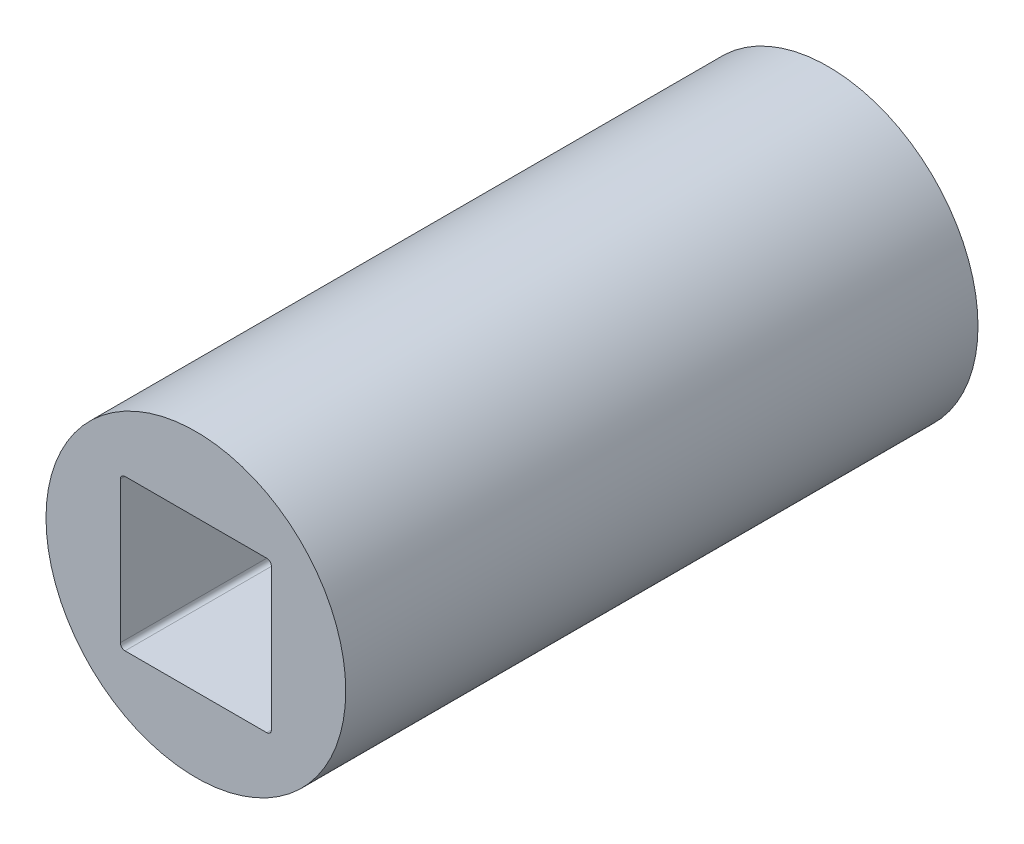
ISO-10303-21;
HEADER;
FILE_DESCRIPTION(('STEP AP214'),'2;1');
FILE_NAME('part.step','',(''),(''),'','','');
FILE_SCHEMA(('AUTOMOTIVE_DESIGN { 1 0 10303 214 1 1 1 1 }'));
ENDSEC;
DATA;
#1=APPLICATION_CONTEXT('core data for automotive mechanical design processes');
#2=APPLICATION_PROTOCOL_DEFINITION('international standard','automotive_design',2000,#1);
#3=PRODUCT_CONTEXT('',#1,'mechanical');
#4=PRODUCT('Part','Part','',(#3));
#5=PRODUCT_RELATED_PRODUCT_CATEGORY('part','',(#4));
#6=PRODUCT_DEFINITION_FORMATION('','',#4);
#7=PRODUCT_DEFINITION_CONTEXT('part definition',#1,'design');
#8=PRODUCT_DEFINITION('design','',#6,#7);
#9=PRODUCT_DEFINITION_SHAPE('','',#8);
#10=(LENGTH_UNIT() NAMED_UNIT(*) SI_UNIT(.MILLI.,.METRE.));
#11=(NAMED_UNIT(*) PLANE_ANGLE_UNIT() SI_UNIT($,.RADIAN.));
#12=(NAMED_UNIT(*) SI_UNIT($,.STERADIAN.) SOLID_ANGLE_UNIT());
#13=UNCERTAINTY_MEASURE_WITH_UNIT(LENGTH_MEASURE(1.E-05),#10,'distance_accuracy_value','');
#14=(GEOMETRIC_REPRESENTATION_CONTEXT(3) GLOBAL_UNCERTAINTY_ASSIGNED_CONTEXT((#13)) GLOBAL_UNIT_ASSIGNED_CONTEXT((#10,
#11,#12)) REPRESENTATION_CONTEXT('',''));
#15=CARTESIAN_POINT('',(0.,0.,0.));
#16=DIRECTION('',(0.,0.,1.));
#17=DIRECTION('',(1.,0.,0.));
#18=AXIS2_PLACEMENT_3D('',#15,#16,#17);
#19=CARTESIAN_POINT('',(0.,0.,6.75));
#20=DIRECTION('',(0.,0.,-1.));
#21=DIRECTION('',(-1.,0.,0.));
#22=AXIS2_PLACEMENT_3D('',#19,#20,#21);
#23=CYLINDRICAL_SURFACE('',#22,1.5875);
#24=CARTESIAN_POINT('',(0.,0.,-1.));
#25=DIRECTION('',(0.,0.,-1.));
#26=DIRECTION('',(-1.,0.,0.));
#27=AXIS2_PLACEMENT_3D('',#24,#25,#26);
#28=CIRCLE('',#27,1.5875);
#29=CARTESIAN_POINT('',(-1.5875,0.,-1.));
#30=VERTEX_POINT('',#29);
#31=EDGE_CURVE('E163',#30,#30,#28,.F.);
#32=ORIENTED_EDGE('',*,*,#31,.F.);
#33=EDGE_LOOP('',(#32));
#34=FACE_BOUND('',#33,.T.);
#35=CARTESIAN_POINT('',(0.,0.,1.));
#36=DIRECTION('',(0.,0.,-1.));
#37=DIRECTION('',(-1.,0.,0.));
#38=AXIS2_PLACEMENT_3D('',#35,#36,#37);
#39=CIRCLE('',#38,1.5875);
#40=CARTESIAN_POINT('',(-1.5875,0.,1.));
#41=VERTEX_POINT('',#40);
#42=EDGE_CURVE('E42',#41,#41,#39,.T.);
#43=ORIENTED_EDGE('',*,*,#42,.F.);
#44=EDGE_LOOP('',(#43));
#45=FACE_BOUND('',#44,.T.);
#46=ADVANCED_FACE('F39',(#34,#45),#23,.F.);
#47=CARTESIAN_POINT('',(0.,0.,1.));
#48=DIRECTION('',(0.,0.,1.));
#49=DIRECTION('',(1.,0.,0.));
#50=AXIS2_PLACEMENT_3D('',#47,#48,#49);
#51=PLANE('',#50);
#52=DIRECTION('',(1.,0.,0.));
#53=VECTOR('',#52,1.);
#54=CARTESIAN_POINT('',(-1.6129,-1.6129,1.));
#55=LINE('',#54,#53);
#56=CARTESIAN_POINT('',(-1.5129,-1.6129,1.));
#57=VERTEX_POINT('',#56);
#58=CARTESIAN_POINT('',(1.5129,-1.6129,1.));
#59=VERTEX_POINT('',#58);
#60=EDGE_CURVE('E149',#57,#59,#55,.T.);
#61=ORIENTED_EDGE('',*,*,#60,.T.);
#62=CARTESIAN_POINT('',(1.5129,-1.5129,1.));
#63=DIRECTION('',(0.,0.,-1.));
#64=DIRECTION('',(-1.,0.,0.));
#65=AXIS2_PLACEMENT_3D('',#62,#63,#64);
#66=CIRCLE('',#65,0.1);
#67=CARTESIAN_POINT('',(1.6129,-1.5129,1.));
#68=VERTEX_POINT('',#67);
#69=EDGE_CURVE('E165',#59,#68,#66,.F.);
#70=ORIENTED_EDGE('',*,*,#69,.T.);
#71=DIRECTION('',(0.,1.,0.));
#72=VECTOR('',#71,1.);
#73=CARTESIAN_POINT('',(1.6129,1.6129,1.));
#74=LINE('',#73,#72);
#75=CARTESIAN_POINT('',(1.6129,1.5129,1.));
#76=VERTEX_POINT('',#75);
#77=EDGE_CURVE('E154',#68,#76,#74,.T.);
#78=ORIENTED_EDGE('',*,*,#77,.T.);
#79=CARTESIAN_POINT('',(1.5129,1.5129,1.));
#80=DIRECTION('',(0.,0.,-1.));
#81=DIRECTION('',(-1.,0.,0.));
#82=AXIS2_PLACEMENT_3D('',#79,#80,#81);
#83=CIRCLE('',#82,0.1);
#84=CARTESIAN_POINT('',(1.5129,1.6129,1.));
#85=VERTEX_POINT('',#84);
#86=EDGE_CURVE('E238',#76,#85,#83,.F.);
#87=ORIENTED_EDGE('',*,*,#86,.T.);
#88=DIRECTION('',(1.,0.,0.));
#89=VECTOR('',#88,1.);
#90=CARTESIAN_POINT('',(-1.6129,1.6129,1.));
#91=LINE('',#90,#89);
#92=CARTESIAN_POINT('',(-1.5129,1.6129,1.));
#93=VERTEX_POINT('',#92);
#94=EDGE_CURVE('E196',#85,#93,#91,.F.);
#95=ORIENTED_EDGE('',*,*,#94,.T.);
#96=CARTESIAN_POINT('',(-1.5129,1.5129,1.));
#97=DIRECTION('',(0.,0.,-1.));
#98=DIRECTION('',(-1.,0.,0.));
#99=AXIS2_PLACEMENT_3D('',#96,#97,#98);
#100=CIRCLE('',#99,0.1);
#101=CARTESIAN_POINT('',(-1.6129,1.5129,1.));
#102=VERTEX_POINT('',#101);
#103=EDGE_CURVE('E240',#93,#102,#100,.F.);
#104=ORIENTED_EDGE('',*,*,#103,.T.);
#105=DIRECTION('',(0.,-1.,0.));
#106=VECTOR('',#105,1.);
#107=CARTESIAN_POINT('',(-1.6129,1.6129,1.));
#108=LINE('',#107,#106);
#109=CARTESIAN_POINT('',(-1.6129,-1.5129,1.));
#110=VERTEX_POINT('',#109);
#111=EDGE_CURVE('E201',#102,#110,#108,.T.);
#112=ORIENTED_EDGE('',*,*,#111,.T.);
#113=CARTESIAN_POINT('',(-1.5129,-1.5129,1.));
#114=DIRECTION('',(0.,0.,-1.));
#115=DIRECTION('',(-1.,0.,0.));
#116=AXIS2_PLACEMENT_3D('',#113,#114,#115);
#117=CIRCLE('',#116,0.1);
#118=EDGE_CURVE('E204',#110,#57,#117,.F.);
#119=ORIENTED_EDGE('',*,*,#118,.T.);
#120=EDGE_LOOP('',(#61,#70,#78,#87,#95,#104,#112,#119));
#121=FACE_BOUND('',#120,.T.);
#122=ORIENTED_EDGE('',*,*,#42,.T.);
#123=EDGE_LOOP('',(#122));
#124=FACE_BOUND('',#123,.T.);
#125=ADVANCED_FACE('F166',(#121,#124),#51,.T.);
#126=CARTESIAN_POINT('',(0.,0.,-1.));
#127=DIRECTION('',(0.,0.,-1.));
#128=DIRECTION('',(-1.,0.,0.));
#129=AXIS2_PLACEMENT_3D('',#126,#127,#128);
#130=PLANE('',#129);
#131=DIRECTION('',(0.,-1.,0.));
#132=VECTOR('',#131,1.);
#133=CARTESIAN_POINT('',(-1.6129,1.6129,-1.));
#134=LINE('',#133,#132);
#135=CARTESIAN_POINT('',(-1.6129,-1.5129,-1.));
#136=VERTEX_POINT('',#135);
#137=CARTESIAN_POINT('',(-1.6129,1.5129,-1.));
#138=VERTEX_POINT('',#137);
#139=EDGE_CURVE('E180',#136,#138,#134,.F.);
#140=ORIENTED_EDGE('',*,*,#139,.T.);
#141=CARTESIAN_POINT('',(-1.5129,1.5129,-1.));
#142=DIRECTION('',(0.,0.,1.));
#143=DIRECTION('',(1.,0.,0.));
#144=AXIS2_PLACEMENT_3D('',#141,#142,#143);
#145=CIRCLE('',#144,0.1);
#146=CARTESIAN_POINT('',(-1.5129,1.6129,-1.));
#147=VERTEX_POINT('',#146);
#148=EDGE_CURVE('E236',#138,#147,#145,.F.);
#149=ORIENTED_EDGE('',*,*,#148,.T.);
#150=DIRECTION('',(1.,0.,0.));
#151=VECTOR('',#150,1.);
#152=CARTESIAN_POINT('',(-1.6129,1.6129,-1.));
#153=LINE('',#152,#151);
#154=CARTESIAN_POINT('',(1.5129,1.6129,-1.));
#155=VERTEX_POINT('',#154);
#156=EDGE_CURVE('E192',#147,#155,#153,.T.);
#157=ORIENTED_EDGE('',*,*,#156,.T.);
#158=CARTESIAN_POINT('',(1.5129,1.5129,-1.));
#159=DIRECTION('',(0.,0.,1.));
#160=DIRECTION('',(1.,0.,0.));
#161=AXIS2_PLACEMENT_3D('',#158,#159,#160);
#162=CIRCLE('',#161,0.1);
#163=CARTESIAN_POINT('',(1.6129,1.5129,-1.));
#164=VERTEX_POINT('',#163);
#165=EDGE_CURVE('E234',#155,#164,#162,.F.);
#166=ORIENTED_EDGE('',*,*,#165,.T.);
#167=DIRECTION('',(0.,1.,0.));
#168=VECTOR('',#167,1.);
#169=CARTESIAN_POINT('',(1.6129,1.6129,-1.));
#170=LINE('',#169,#168);
#171=CARTESIAN_POINT('',(1.6129,-1.5129,-1.));
#172=VERTEX_POINT('',#171);
#173=EDGE_CURVE('E188',#164,#172,#170,.F.);
#174=ORIENTED_EDGE('',*,*,#173,.T.);
#175=CARTESIAN_POINT('',(1.5129,-1.5129,-1.));
#176=DIRECTION('',(0.,0.,1.));
#177=DIRECTION('',(1.,0.,0.));
#178=AXIS2_PLACEMENT_3D('',#175,#176,#177);
#179=CIRCLE('',#178,0.1);
#180=CARTESIAN_POINT('',(1.5129,-1.6129,-1.));
#181=VERTEX_POINT('',#180);
#182=EDGE_CURVE('E232',#172,#181,#179,.F.);
#183=ORIENTED_EDGE('',*,*,#182,.T.);
#184=DIRECTION('',(1.,0.,0.));
#185=VECTOR('',#184,1.);
#186=CARTESIAN_POINT('',(-1.6129,-1.6129,-1.));
#187=LINE('',#186,#185);
#188=CARTESIAN_POINT('',(-1.5129,-1.6129,-1.));
#189=VERTEX_POINT('',#188);
#190=EDGE_CURVE('E184',#181,#189,#187,.F.);
#191=ORIENTED_EDGE('',*,*,#190,.T.);
#192=CARTESIAN_POINT('',(-1.5129,-1.5129,-1.));
#193=DIRECTION('',(0.,0.,1.));
#194=DIRECTION('',(1.,0.,0.));
#195=AXIS2_PLACEMENT_3D('',#192,#193,#194);
#196=CIRCLE('',#195,0.1);
#197=EDGE_CURVE('E230',#189,#136,#196,.F.);
#198=ORIENTED_EDGE('',*,*,#197,.T.);
#199=EDGE_LOOP('',(#140,#149,#157,#166,#174,#183,#191,#198));
#200=FACE_BOUND('',#199,.T.);
#201=ORIENTED_EDGE('',*,*,#31,.T.);
#202=EDGE_LOOP('',(#201));
#203=FACE_BOUND('',#202,.T.);
#204=ADVANCED_FACE('F438',(#200,#203),#130,.T.);
#205=CARTESIAN_POINT('',(1.6129,1.6129,-4.56197010950313));
#206=DIRECTION('',(1.,0.,0.));
#207=DIRECTION('',(0.,1.,0.));
#208=AXIS2_PLACEMENT_3D('',#205,#206,#207);
#209=PLANE('',#208);
#210=DIRECTION('',(0.,0.,-1.));
#211=VECTOR('',#210,1.);
#212=CARTESIAN_POINT('',(1.6129,1.5129,-4.56197010950313));
#213=LINE('',#212,#211);
#214=CARTESIAN_POINT('',(1.6129,1.5129,6.75));
#215=VERTEX_POINT('',#214);
#216=EDGE_CURVE('E160',#215,#76,#213,.T.);
#217=ORIENTED_EDGE('',*,*,#216,.T.);
#218=ORIENTED_EDGE('',*,*,#77,.F.);
#219=DIRECTION('',(0.,0.,-1.));
#220=VECTOR('',#219,1.);
#221=CARTESIAN_POINT('',(1.6129,-1.5129,-4.56197010950313));
#222=LINE('',#221,#220);
#223=CARTESIAN_POINT('',(1.6129,-1.5129,6.75));
#224=VERTEX_POINT('',#223);
#225=EDGE_CURVE('E157',#68,#224,#222,.F.);
#226=ORIENTED_EDGE('',*,*,#225,.T.);
#227=DIRECTION('',(0.,1.,0.));
#228=VECTOR('',#227,1.);
#229=CARTESIAN_POINT('',(1.6129,0.,6.75));
#230=LINE('',#229,#228);
#231=EDGE_CURVE('E229',#215,#224,#230,.F.);
#232=ORIENTED_EDGE('',*,*,#231,.F.);
#233=EDGE_LOOP('',(#217,#218,#226,#232));
#234=FACE_BOUND('',#233,.T.);
#235=ADVANCED_FACE('F155',(#234),#209,.F.);
#236=CARTESIAN_POINT('',(1.5129,-1.5129,-4.56197010950313));
#237=DIRECTION('',(0.,0.,-1.));
#238=DIRECTION('',(-1.,0.,0.));
#239=AXIS2_PLACEMENT_3D('',#236,#237,#238);
#240=CYLINDRICAL_SURFACE('',#239,0.1);
#241=DIRECTION('',(0.,0.,-1.));
#242=VECTOR('',#241,1.);
#243=CARTESIAN_POINT('',(1.5129,-1.6129,-4.56197010950313));
#244=LINE('',#243,#242);
#245=CARTESIAN_POINT('',(1.5129,-1.6129,6.75));
#246=VERTEX_POINT('',#245);
#247=EDGE_CURVE('E178',#59,#246,#244,.F.);
#248=ORIENTED_EDGE('',*,*,#247,.T.);
#249=CARTESIAN_POINT('',(1.5129,-1.5129,6.75));
#250=DIRECTION('',(0.,0.,-1.));
#251=DIRECTION('',(-1.,0.,0.));
#252=AXIS2_PLACEMENT_3D('',#249,#250,#251);
#253=CIRCLE('',#252,0.1);
#254=EDGE_CURVE('E173',#224,#246,#253,.T.);
#255=ORIENTED_EDGE('',*,*,#254,.F.);
#256=ORIENTED_EDGE('',*,*,#225,.F.);
#257=ORIENTED_EDGE('',*,*,#69,.F.);
#258=EDGE_LOOP('',(#248,#255,#256,#257));
#259=FACE_BOUND('',#258,.T.);
#260=ADVANCED_FACE('F171',(#259),#240,.F.);
#261=CARTESIAN_POINT('',(-1.6129,-1.6129,-4.56197010950313));
#262=DIRECTION('',(0.,-1.,0.));
#263=DIRECTION('',(0.,0.,-1.));
#264=AXIS2_PLACEMENT_3D('',#261,#262,#263);
#265=PLANE('',#264);
#266=ORIENTED_EDGE('',*,*,#247,.F.);
#267=ORIENTED_EDGE('',*,*,#60,.F.);
#268=DIRECTION('',(0.,0.,-1.));
#269=VECTOR('',#268,1.);
#270=CARTESIAN_POINT('',(-1.5129,-1.6129,-4.56197010950313));
#271=LINE('',#270,#269);
#272=CARTESIAN_POINT('',(-1.5129,-1.6129,6.75));
#273=VERTEX_POINT('',#272);
#274=EDGE_CURVE('E244',#57,#273,#271,.F.);
#275=ORIENTED_EDGE('',*,*,#274,.T.);
#276=DIRECTION('',(1.,0.,0.));
#277=VECTOR('',#276,1.);
#278=CARTESIAN_POINT('',(0.,-1.6129,6.75));
#279=LINE('',#278,#277);
#280=EDGE_CURVE('E227',#246,#273,#279,.F.);
#281=ORIENTED_EDGE('',*,*,#280,.F.);
#282=EDGE_LOOP('',(#266,#267,#275,#281));
#283=FACE_BOUND('',#282,.T.);
#284=ADVANCED_FACE('F291',(#283),#265,.F.);
#285=CARTESIAN_POINT('',(-1.5129,-1.5129,-4.56197010950313));
#286=DIRECTION('',(0.,0.,-1.));
#287=DIRECTION('',(-1.,0.,0.));
#288=AXIS2_PLACEMENT_3D('',#285,#286,#287);
#289=CYLINDRICAL_SURFACE('',#288,0.1);
#290=DIRECTION('',(0.,0.,1.));
#291=VECTOR('',#290,1.);
#292=CARTESIAN_POINT('',(-1.6129,-1.5129,-4.56197010950313));
#293=LINE('',#292,#291);
#294=CARTESIAN_POINT('',(-1.6129,-1.5129,6.75));
#295=VERTEX_POINT('',#294);
#296=EDGE_CURVE('E203',#110,#295,#293,.T.);
#297=ORIENTED_EDGE('',*,*,#296,.T.);
#298=CARTESIAN_POINT('',(-1.5129,-1.5129,6.75));
#299=DIRECTION('',(0.,0.,-1.));
#300=DIRECTION('',(-1.,0.,0.));
#301=AXIS2_PLACEMENT_3D('',#298,#299,#300);
#302=CIRCLE('',#301,0.1);
#303=EDGE_CURVE('E224',#273,#295,#302,.T.);
#304=ORIENTED_EDGE('',*,*,#303,.F.);
#305=ORIENTED_EDGE('',*,*,#274,.F.);
#306=ORIENTED_EDGE('',*,*,#118,.F.);
#307=EDGE_LOOP('',(#297,#304,#305,#306));
#308=FACE_BOUND('',#307,.T.);
#309=ADVANCED_FACE('F313',(#308),#289,.F.);
#310=CARTESIAN_POINT('',(-1.6129,1.6129,-4.56197010950313));
#311=DIRECTION('',(-1.,0.,0.));
#312=DIRECTION('',(0.,-1.,0.));
#313=AXIS2_PLACEMENT_3D('',#310,#311,#312);
#314=PLANE('',#313);
#315=ORIENTED_EDGE('',*,*,#296,.F.);
#316=ORIENTED_EDGE('',*,*,#111,.F.);
#317=DIRECTION('',(0.,0.,-1.));
#318=VECTOR('',#317,1.);
#319=CARTESIAN_POINT('',(-1.6129,1.5129,-4.56197010950313));
#320=LINE('',#319,#318);
#321=CARTESIAN_POINT('',(-1.6129,1.5129,6.75));
#322=VERTEX_POINT('',#321);
#323=EDGE_CURVE('E243',#102,#322,#320,.F.);
#324=ORIENTED_EDGE('',*,*,#323,.T.);
#325=DIRECTION('',(0.,1.,0.));
#326=VECTOR('',#325,1.);
#327=CARTESIAN_POINT('',(-1.6129,0.,6.75));
#328=LINE('',#327,#326);
#329=EDGE_CURVE('E223',#295,#322,#328,.T.);
#330=ORIENTED_EDGE('',*,*,#329,.F.);
#331=EDGE_LOOP('',(#315,#316,#324,#330));
#332=FACE_BOUND('',#331,.T.);
#333=ADVANCED_FACE('F310',(#332),#314,.F.);
#334=CARTESIAN_POINT('',(-1.5129,1.5129,-4.56197010950313));
#335=DIRECTION('',(0.,0.,-1.));
#336=DIRECTION('',(-1.,0.,0.));
#337=AXIS2_PLACEMENT_3D('',#334,#335,#336);
#338=CYLINDRICAL_SURFACE('',#337,0.1);
#339=DIRECTION('',(0.,0.,1.));
#340=VECTOR('',#339,1.);
#341=CARTESIAN_POINT('',(-1.5129,1.6129,-4.56197010950313));
#342=LINE('',#341,#340);
#343=CARTESIAN_POINT('',(-1.5129,1.6129,6.75));
#344=VERTEX_POINT('',#343);
#345=EDGE_CURVE('E200',#93,#344,#342,.T.);
#346=ORIENTED_EDGE('',*,*,#345,.T.);
#347=CARTESIAN_POINT('',(-1.5129,1.5129,6.75));
#348=DIRECTION('',(0.,0.,-1.));
#349=DIRECTION('',(-1.,0.,0.));
#350=AXIS2_PLACEMENT_3D('',#347,#348,#349);
#351=CIRCLE('',#350,0.1);
#352=EDGE_CURVE('E220',#322,#344,#351,.T.);
#353=ORIENTED_EDGE('',*,*,#352,.F.);
#354=ORIENTED_EDGE('',*,*,#323,.F.);
#355=ORIENTED_EDGE('',*,*,#103,.F.);
#356=EDGE_LOOP('',(#346,#353,#354,#355));
#357=FACE_BOUND('',#356,.T.);
#358=ADVANCED_FACE('F306',(#357),#338,.F.);
#359=CARTESIAN_POINT('',(-1.6129,1.6129,-4.56197010950313));
#360=DIRECTION('',(0.,1.,0.));
#361=DIRECTION('',(0.,0.,1.));
#362=AXIS2_PLACEMENT_3D('',#359,#360,#361);
#363=PLANE('',#362);
#364=DIRECTION('',(0.,0.,-1.));
#365=VECTOR('',#364,1.);
#366=CARTESIAN_POINT('',(1.5129,1.6129,-4.56197010950313));
#367=LINE('',#366,#365);
#368=CARTESIAN_POINT('',(1.5129,1.6129,6.75));
#369=VERTEX_POINT('',#368);
#370=EDGE_CURVE('E199',#85,#369,#367,.F.);
#371=ORIENTED_EDGE('',*,*,#370,.T.);
#372=DIRECTION('',(1.,0.,0.));
#373=VECTOR('',#372,1.);
#374=CARTESIAN_POINT('',(0.,1.6129,6.75));
#375=LINE('',#374,#373);
#376=EDGE_CURVE('E219',#344,#369,#375,.T.);
#377=ORIENTED_EDGE('',*,*,#376,.F.);
#378=ORIENTED_EDGE('',*,*,#345,.F.);
#379=ORIENTED_EDGE('',*,*,#94,.F.);
#380=EDGE_LOOP('',(#371,#377,#378,#379));
#381=FACE_BOUND('',#380,.T.);
#382=ADVANCED_FACE('F303',(#381),#363,.F.);
#383=CARTESIAN_POINT('',(1.5129,1.5129,-4.56197010950313));
#384=DIRECTION('',(0.,0.,-1.));
#385=DIRECTION('',(-1.,0.,0.));
#386=AXIS2_PLACEMENT_3D('',#383,#384,#385);
#387=CYLINDRICAL_SURFACE('',#386,0.1);
#388=ORIENTED_EDGE('',*,*,#216,.F.);
#389=CARTESIAN_POINT('',(1.5129,1.5129,6.75));
#390=DIRECTION('',(0.,0.,-1.));
#391=DIRECTION('',(-1.,0.,0.));
#392=AXIS2_PLACEMENT_3D('',#389,#390,#391);
#393=CIRCLE('',#392,0.1);
#394=EDGE_CURVE('E216',#369,#215,#393,.T.);
#395=ORIENTED_EDGE('',*,*,#394,.F.);
#396=ORIENTED_EDGE('',*,*,#370,.F.);
#397=ORIENTED_EDGE('',*,*,#86,.F.);
#398=EDGE_LOOP('',(#388,#395,#396,#397));
#399=FACE_BOUND('',#398,.T.);
#400=ADVANCED_FACE('F297',(#399),#387,.F.);
#401=CARTESIAN_POINT('',(-1.5129,1.5129,4.56197010950313));
#402=DIRECTION('',(0.,0.,1.));
#403=DIRECTION('',(1.,0.,0.));
#404=AXIS2_PLACEMENT_3D('',#401,#402,#403);
#405=CYLINDRICAL_SURFACE('',#404,0.1);
#406=DIRECTION('',(0.,0.,1.));
#407=VECTOR('',#406,1.);
#408=CARTESIAN_POINT('',(-1.6129,1.5129,4.56197010950313));
#409=LINE('',#408,#407);
#410=CARTESIAN_POINT('',(-1.6129,1.5129,-6.75));
#411=VERTEX_POINT('',#410);
#412=EDGE_CURVE('E182',#138,#411,#409,.F.);
#413=ORIENTED_EDGE('',*,*,#412,.T.);
#414=CARTESIAN_POINT('',(-1.5129,1.5129,-6.75));
#415=DIRECTION('',(0.,0.,1.));
#416=DIRECTION('',(1.,0.,0.));
#417=AXIS2_PLACEMENT_3D('',#414,#415,#416);
#418=CIRCLE('',#417,0.1);
#419=CARTESIAN_POINT('',(-1.5129,1.6129,-6.75));
#420=VERTEX_POINT('',#419);
#421=EDGE_CURVE('E214',#411,#420,#418,.F.);
#422=ORIENTED_EDGE('',*,*,#421,.T.);
#423=DIRECTION('',(0.,0.,1.));
#424=VECTOR('',#423,1.);
#425=CARTESIAN_POINT('',(-1.5129,1.6129,4.56197010950313));
#426=LINE('',#425,#424);
#427=EDGE_CURVE('E194',#420,#147,#426,.T.);
#428=ORIENTED_EDGE('',*,*,#427,.T.);
#429=ORIENTED_EDGE('',*,*,#148,.F.);
#430=EDGE_LOOP('',(#413,#422,#428,#429));
#431=FACE_BOUND('',#430,.T.);
#432=ADVANCED_FACE('F361',(#431),#405,.F.);
#433=CARTESIAN_POINT('',(-1.6129,1.6129,4.56197010950313));
#434=DIRECTION('',(0.,1.,0.));
#435=DIRECTION('',(0.,0.,1.));
#436=AXIS2_PLACEMENT_3D('',#433,#434,#435);
#437=PLANE('',#436);
#438=DIRECTION('',(0.,0.,1.));
#439=VECTOR('',#438,1.);
#440=CARTESIAN_POINT('',(1.5129,1.6129,4.56197010950313));
#441=LINE('',#440,#439);
#442=CARTESIAN_POINT('',(1.5129,1.6129,-6.75));
#443=VERTEX_POINT('',#442);
#444=EDGE_CURVE('E193',#443,#155,#441,.T.);
#445=ORIENTED_EDGE('',*,*,#444,.T.);
#446=ORIENTED_EDGE('',*,*,#156,.F.);
#447=ORIENTED_EDGE('',*,*,#427,.F.);
#448=DIRECTION('',(1.,0.,0.));
#449=VECTOR('',#448,1.);
#450=CARTESIAN_POINT('',(0.,1.6129,-6.75));
#451=LINE('',#450,#449);
#452=EDGE_CURVE('E213',#420,#443,#451,.T.);
#453=ORIENTED_EDGE('',*,*,#452,.T.);
#454=EDGE_LOOP('',(#445,#446,#447,#453));
#455=FACE_BOUND('',#454,.T.);
#456=ADVANCED_FACE('F357',(#455),#437,.F.);
#457=CARTESIAN_POINT('',(1.5129,1.5129,4.56197010950313));
#458=DIRECTION('',(0.,0.,1.));
#459=DIRECTION('',(1.,0.,0.));
#460=AXIS2_PLACEMENT_3D('',#457,#458,#459);
#461=CYLINDRICAL_SURFACE('',#460,0.1);
#462=ORIENTED_EDGE('',*,*,#444,.F.);
#463=CARTESIAN_POINT('',(1.5129,1.5129,-6.75));
#464=DIRECTION('',(0.,0.,1.));
#465=DIRECTION('',(1.,0.,0.));
#466=AXIS2_PLACEMENT_3D('',#463,#464,#465);
#467=CIRCLE('',#466,0.1);
#468=CARTESIAN_POINT('',(1.6129,1.5129,-6.75));
#469=VERTEX_POINT('',#468);
#470=EDGE_CURVE('E211',#443,#469,#467,.F.);
#471=ORIENTED_EDGE('',*,*,#470,.T.);
#472=DIRECTION('',(0.,0.,1.));
#473=VECTOR('',#472,1.);
#474=CARTESIAN_POINT('',(1.6129,1.5129,4.56197010950313));
#475=LINE('',#474,#473);
#476=EDGE_CURVE('E191',#469,#164,#475,.T.);
#477=ORIENTED_EDGE('',*,*,#476,.T.);
#478=ORIENTED_EDGE('',*,*,#165,.F.);
#479=EDGE_LOOP('',(#462,#471,#477,#478));
#480=FACE_BOUND('',#479,.T.);
#481=ADVANCED_FACE('F353',(#480),#461,.F.);
#482=CARTESIAN_POINT('',(1.6129,1.6129,4.56197010950313));
#483=DIRECTION('',(1.,0.,0.));
#484=DIRECTION('',(0.,1.,0.));
#485=AXIS2_PLACEMENT_3D('',#482,#483,#484);
#486=PLANE('',#485);
#487=ORIENTED_EDGE('',*,*,#476,.F.);
#488=DIRECTION('',(0.,1.,0.));
#489=VECTOR('',#488,1.);
#490=CARTESIAN_POINT('',(1.6129,0.,-6.75));
#491=LINE('',#490,#489);
#492=CARTESIAN_POINT('',(1.6129,-1.5129,-6.75));
#493=VERTEX_POINT('',#492);
#494=EDGE_CURVE('E210',#469,#493,#491,.F.);
#495=ORIENTED_EDGE('',*,*,#494,.T.);
#496=DIRECTION('',(0.,0.,1.));
#497=VECTOR('',#496,1.);
#498=CARTESIAN_POINT('',(1.6129,-1.5129,4.56197010950313));
#499=LINE('',#498,#497);
#500=EDGE_CURVE('E190',#493,#172,#499,.T.);
#501=ORIENTED_EDGE('',*,*,#500,.T.);
#502=ORIENTED_EDGE('',*,*,#173,.F.);
#503=EDGE_LOOP('',(#487,#495,#501,#502));
#504=FACE_BOUND('',#503,.T.);
#505=ADVANCED_FACE('F349',(#504),#486,.F.);
#506=CARTESIAN_POINT('',(1.5129,-1.5129,4.56197010950313));
#507=DIRECTION('',(0.,0.,1.));
#508=DIRECTION('',(1.,0.,0.));
#509=AXIS2_PLACEMENT_3D('',#506,#507,#508);
#510=CYLINDRICAL_SURFACE('',#509,0.1);
#511=ORIENTED_EDGE('',*,*,#500,.F.);
#512=CARTESIAN_POINT('',(1.5129,-1.5129,-6.75));
#513=DIRECTION('',(0.,0.,1.));
#514=DIRECTION('',(1.,0.,0.));
#515=AXIS2_PLACEMENT_3D('',#512,#513,#514);
#516=CIRCLE('',#515,0.1);
#517=CARTESIAN_POINT('',(1.5129,-1.6129,-6.75));
#518=VERTEX_POINT('',#517);
#519=EDGE_CURVE('E208',#493,#518,#516,.F.);
#520=ORIENTED_EDGE('',*,*,#519,.T.);
#521=DIRECTION('',(0.,0.,-1.));
#522=VECTOR('',#521,1.);
#523=CARTESIAN_POINT('',(1.5129,-1.6129,4.56197010950313));
#524=LINE('',#523,#522);
#525=EDGE_CURVE('E187',#518,#181,#524,.F.);
#526=ORIENTED_EDGE('',*,*,#525,.T.);
#527=ORIENTED_EDGE('',*,*,#182,.F.);
#528=EDGE_LOOP('',(#511,#520,#526,#527));
#529=FACE_BOUND('',#528,.T.);
#530=ADVANCED_FACE('F345',(#529),#510,.F.);
#531=CARTESIAN_POINT('',(-1.6129,-1.6129,4.56197010950313));
#532=DIRECTION('',(0.,-1.,0.));
#533=DIRECTION('',(0.,0.,-1.));
#534=AXIS2_PLACEMENT_3D('',#531,#532,#533);
#535=PLANE('',#534);
#536=DIRECTION('',(0.,0.,1.));
#537=VECTOR('',#536,1.);
#538=CARTESIAN_POINT('',(-1.5129,-1.6129,4.56197010950313));
#539=LINE('',#538,#537);
#540=CARTESIAN_POINT('',(-1.5129,-1.6129,-6.75));
#541=VERTEX_POINT('',#540);
#542=EDGE_CURVE('E186',#541,#189,#539,.T.);
#543=ORIENTED_EDGE('',*,*,#542,.T.);
#544=ORIENTED_EDGE('',*,*,#190,.F.);
#545=ORIENTED_EDGE('',*,*,#525,.F.);
#546=DIRECTION('',(1.,0.,0.));
#547=VECTOR('',#546,1.);
#548=CARTESIAN_POINT('',(0.,-1.6129,-6.75));
#549=LINE('',#548,#547);
#550=EDGE_CURVE('E207',#518,#541,#549,.F.);
#551=ORIENTED_EDGE('',*,*,#550,.T.);
#552=EDGE_LOOP('',(#543,#544,#545,#551));
#553=FACE_BOUND('',#552,.T.);
#554=ADVANCED_FACE('F342',(#553),#535,.F.);
#555=CARTESIAN_POINT('',(-1.5129,-1.5129,4.56197010950313));
#556=DIRECTION('',(0.,0.,1.));
#557=DIRECTION('',(1.,0.,0.));
#558=AXIS2_PLACEMENT_3D('',#555,#556,#557);
#559=CYLINDRICAL_SURFACE('',#558,0.1);
#560=ORIENTED_EDGE('',*,*,#542,.F.);
#561=CARTESIAN_POINT('',(-1.5129,-1.5129,-6.75));
#562=DIRECTION('',(0.,0.,1.));
#563=DIRECTION('',(1.,0.,0.));
#564=AXIS2_PLACEMENT_3D('',#561,#562,#563);
#565=CIRCLE('',#564,0.1);
#566=CARTESIAN_POINT('',(-1.6129,-1.5129,-6.75));
#567=VERTEX_POINT('',#566);
#568=EDGE_CURVE('E48',#541,#567,#565,.F.);
#569=ORIENTED_EDGE('',*,*,#568,.T.);
#570=DIRECTION('',(0.,0.,1.));
#571=VECTOR('',#570,1.);
#572=CARTESIAN_POINT('',(-1.6129,-1.5129,4.56197010950313));
#573=LINE('',#572,#571);
#574=EDGE_CURVE('E183',#567,#136,#573,.T.);
#575=ORIENTED_EDGE('',*,*,#574,.T.);
#576=ORIENTED_EDGE('',*,*,#197,.F.);
#577=EDGE_LOOP('',(#560,#569,#575,#576));
#578=FACE_BOUND('',#577,.T.);
#579=ADVANCED_FACE('F338',(#578),#559,.F.);
#580=CARTESIAN_POINT('',(-1.6129,1.6129,4.56197010950313));
#581=DIRECTION('',(-1.,0.,0.));
#582=DIRECTION('',(0.,-1.,0.));
#583=AXIS2_PLACEMENT_3D('',#580,#581,#582);
#584=PLANE('',#583);
#585=ORIENTED_EDGE('',*,*,#412,.F.);
#586=ORIENTED_EDGE('',*,*,#139,.F.);
#587=ORIENTED_EDGE('',*,*,#574,.F.);
#588=DIRECTION('',(0.,1.,0.));
#589=VECTOR('',#588,1.);
#590=CARTESIAN_POINT('',(-1.6129,0.,-6.75));
#591=LINE('',#590,#589);
#592=EDGE_CURVE('E11',#567,#411,#591,.T.);
#593=ORIENTED_EDGE('',*,*,#592,.T.);
#594=EDGE_LOOP('',(#585,#586,#587,#593));
#595=FACE_BOUND('',#594,.T.);
#596=ADVANCED_FACE('F332',(#595),#584,.F.);
#597=CARTESIAN_POINT('',(0.,0.,6.75));
#598=DIRECTION('',(0.,0.,1.));
#599=DIRECTION('',(1.,0.,0.));
#600=AXIS2_PLACEMENT_3D('',#597,#598,#599);
#601=PLANE('',#600);
#602=ORIENTED_EDGE('',*,*,#376,.T.);
#603=ORIENTED_EDGE('',*,*,#394,.T.);
#604=ORIENTED_EDGE('',*,*,#231,.T.);
#605=ORIENTED_EDGE('',*,*,#254,.T.);
#606=ORIENTED_EDGE('',*,*,#280,.T.);
#607=ORIENTED_EDGE('',*,*,#303,.T.);
#608=ORIENTED_EDGE('',*,*,#329,.T.);
#609=ORIENTED_EDGE('',*,*,#352,.T.);
#610=EDGE_LOOP('',(#602,#603,#604,#605,#606,#607,#608,#609));
#611=FACE_BOUND('',#610,.T.);
#612=CARTESIAN_POINT('',(0.,0.,6.75));
#613=DIRECTION('',(0.,0.,1.));
#614=DIRECTION('',(1.,0.,0.));
#615=AXIS2_PLACEMENT_3D('',#612,#613,#614);
#616=CIRCLE('',#615,3.2);
#617=CARTESIAN_POINT('',(3.2,0.,6.75));
#618=VERTEX_POINT('',#617);
#619=EDGE_CURVE('E252',#618,#618,#616,.T.);
#620=ORIENTED_EDGE('',*,*,#619,.T.);
#621=EDGE_LOOP('',(#620));
#622=FACE_BOUND('',#621,.T.);
#623=ADVANCED_FACE('F293',(#611,#622),#601,.T.);
#624=CARTESIAN_POINT('',(0.,0.,-6.75));
#625=DIRECTION('',(0.,0.,1.));
#626=DIRECTION('',(1.,0.,0.));
#627=AXIS2_PLACEMENT_3D('',#624,#625,#626);
#628=PLANE('',#627);
#629=ORIENTED_EDGE('',*,*,#568,.F.);
#630=ORIENTED_EDGE('',*,*,#550,.F.);
#631=ORIENTED_EDGE('',*,*,#519,.F.);
#632=ORIENTED_EDGE('',*,*,#494,.F.);
#633=ORIENTED_EDGE('',*,*,#470,.F.);
#634=ORIENTED_EDGE('',*,*,#452,.F.);
#635=ORIENTED_EDGE('',*,*,#421,.F.);
#636=ORIENTED_EDGE('',*,*,#592,.F.);
#637=EDGE_LOOP('',(#629,#630,#631,#632,#633,#634,#635,#636));
#638=FACE_BOUND('',#637,.T.);
#639=CARTESIAN_POINT('',(0.,0.,-6.75000000001091));
#640=DIRECTION('',(0.,0.,1.));
#641=DIRECTION('',(1.,0.,0.));
#642=AXIS2_PLACEMENT_3D('',#639,#640,#641);
#643=CIRCLE('',#642,3.2);
#644=CARTESIAN_POINT('',(3.2,0.,-6.75000000001091));
#645=VERTEX_POINT('',#644);
#646=EDGE_CURVE('E249',#645,#645,#643,.T.);
#647=ORIENTED_EDGE('',*,*,#646,.F.);
#648=EDGE_LOOP('',(#647));
#649=FACE_BOUND('',#648,.T.);
#650=ADVANCED_FACE('F322',(#638,#649),#628,.F.);
#651=CARTESIAN_POINT('',(0.,0.,6.75));
#652=DIRECTION('',(0.,0.,-1.));
#653=DIRECTION('',(-1.,0.,0.));
#654=AXIS2_PLACEMENT_3D('',#651,#652,#653);
#655=CYLINDRICAL_SURFACE('',#654,3.2);
#656=ORIENTED_EDGE('',*,*,#646,.T.);
#657=EDGE_LOOP('',(#656));
#658=FACE_BOUND('',#657,.T.);
#659=ORIENTED_EDGE('',*,*,#619,.F.);
#660=EDGE_LOOP('',(#659));
#661=FACE_BOUND('',#660,.T.);
#662=ADVANCED_FACE('F324',(#658,#661),#655,.T.);
#663=CLOSED_SHELL('',(#46,#125,#204,#235,#260,#284,#309,#333,#358,#382,#400,#432,#456,#481,#505,
#530,#554,#579,#596,#623,#650,#662));
#664=MANIFOLD_SOLID_BREP('B2',#663);
#665=ADVANCED_BREP_SHAPE_REPRESENTATION('',(#18,#664),#14);
#666=SHAPE_DEFINITION_REPRESENTATION(#9,#665);
ENDSEC;
END-ISO-10303-21;
